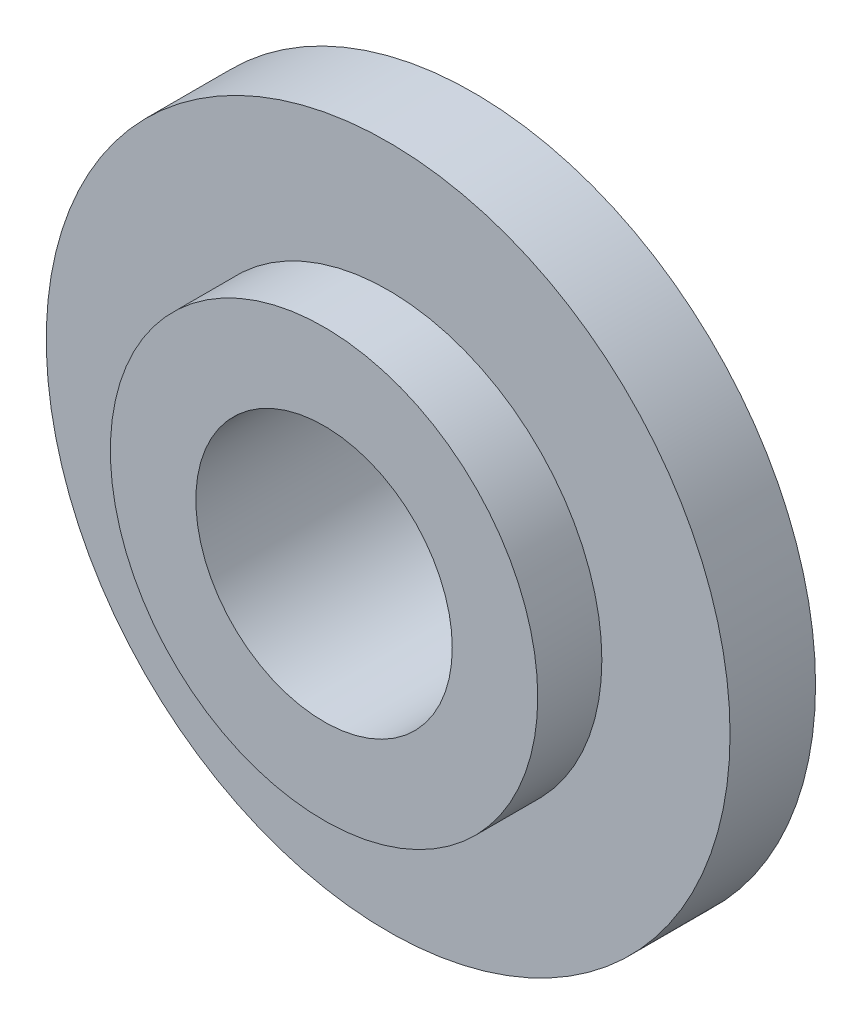
ISO-10303-21;
HEADER;
FILE_DESCRIPTION(('STEP AP214'),'2;1');
FILE_NAME('part.step','',(''),(''),'','','');
FILE_SCHEMA(('AUTOMOTIVE_DESIGN { 1 0 10303 214 1 1 1 1 }'));
ENDSEC;
DATA;
#1=APPLICATION_CONTEXT('core data for automotive mechanical design processes');
#2=APPLICATION_PROTOCOL_DEFINITION('international standard','automotive_design',2000,#1);
#3=PRODUCT_CONTEXT('',#1,'mechanical');
#4=PRODUCT('Part','Part','',(#3));
#5=PRODUCT_RELATED_PRODUCT_CATEGORY('part','',(#4));
#6=PRODUCT_DEFINITION_FORMATION('','',#4);
#7=PRODUCT_DEFINITION_CONTEXT('part definition',#1,'design');
#8=PRODUCT_DEFINITION('design','',#6,#7);
#9=PRODUCT_DEFINITION_SHAPE('','',#8);
#10=(LENGTH_UNIT() NAMED_UNIT(*) SI_UNIT(.MILLI.,.METRE.));
#11=(NAMED_UNIT(*) PLANE_ANGLE_UNIT() SI_UNIT($,.RADIAN.));
#12=(NAMED_UNIT(*) SI_UNIT($,.STERADIAN.) SOLID_ANGLE_UNIT());
#13=UNCERTAINTY_MEASURE_WITH_UNIT(LENGTH_MEASURE(1.E-05),#10,'distance_accuracy_value','');
#14=(GEOMETRIC_REPRESENTATION_CONTEXT(3) GLOBAL_UNCERTAINTY_ASSIGNED_CONTEXT((#13)) GLOBAL_UNIT_ASSIGNED_CONTEXT((#10,
#11,#12)) REPRESENTATION_CONTEXT('',''));
#15=CARTESIAN_POINT('',(0.,0.,0.));
#16=DIRECTION('',(0.,0.,1.));
#17=DIRECTION('',(1.,0.,0.));
#18=AXIS2_PLACEMENT_3D('',#15,#16,#17);
#19=CARTESIAN_POINT('',(0.,0.,25.));
#20=DIRECTION('',(0.,0.,-1.));
#21=DIRECTION('',(-1.,0.,0.));
#22=AXIS2_PLACEMENT_3D('',#19,#20,#21);
#23=CYLINDRICAL_SURFACE('',#22,50.);
#24=CARTESIAN_POINT('',(0.,0.,-25.));
#25=DIRECTION('',(0.,0.,1.));
#26=DIRECTION('',(1.,0.,0.));
#27=AXIS2_PLACEMENT_3D('',#24,#25,#26);
#28=CIRCLE('',#27,50.);
#29=CARTESIAN_POINT('',(50.,0.,-25.));
#30=VERTEX_POINT('',#29);
#31=EDGE_CURVE('E43',#30,#30,#28,.T.);
#32=ORIENTED_EDGE('',*,*,#31,.T.);
#33=EDGE_LOOP('',(#32));
#34=FACE_BOUND('',#33,.T.);
#35=CARTESIAN_POINT('',(0.,0.,-10.));
#36=DIRECTION('',(0.,0.,1.));
#37=DIRECTION('',(1.,0.,0.));
#38=AXIS2_PLACEMENT_3D('',#35,#36,#37);
#39=CIRCLE('',#38,50.);
#40=CARTESIAN_POINT('',(50.,0.,-10.));
#41=VERTEX_POINT('',#40);
#42=EDGE_CURVE('E10',#41,#41,#39,.T.);
#43=ORIENTED_EDGE('',*,*,#42,.F.);
#44=EDGE_LOOP('',(#43));
#45=FACE_BOUND('',#44,.T.);
#46=ADVANCED_FACE('F32',(#34,#45),#23,.T.);
#47=CARTESIAN_POINT('',(0.,0.,25.));
#48=DIRECTION('',(0.,0.,1.));
#49=DIRECTION('',(1.,0.,0.));
#50=AXIS2_PLACEMENT_3D('',#47,#48,#49);
#51=PLANE('',#50);
#52=CARTESIAN_POINT('',(0.,0.,25.));
#53=DIRECTION('',(0.,0.,1.));
#54=DIRECTION('',(1.,0.,0.));
#55=AXIS2_PLACEMENT_3D('',#52,#53,#54);
#56=CIRCLE('',#55,50.);
#57=CARTESIAN_POINT('',(50.,0.,25.));
#58=VERTEX_POINT('',#57);
#59=EDGE_CURVE('E39',#58,#58,#56,.T.);
#60=ORIENTED_EDGE('',*,*,#59,.T.);
#61=EDGE_LOOP('',(#60));
#62=FACE_BOUND('',#61,.T.);
#63=CARTESIAN_POINT('',(0.,0.,25.));
#64=DIRECTION('',(0.,0.,1.));
#65=DIRECTION('',(1.,0.,0.));
#66=AXIS2_PLACEMENT_3D('',#63,#64,#65);
#67=CIRCLE('',#66,30.);
#68=CARTESIAN_POINT('',(30.,0.,25.));
#69=VERTEX_POINT('',#68);
#70=EDGE_CURVE('E48',#69,#69,#67,.T.);
#71=ORIENTED_EDGE('',*,*,#70,.F.);
#72=EDGE_LOOP('',(#71));
#73=FACE_BOUND('',#72,.T.);
#74=ADVANCED_FACE('F83',(#62,#73),#51,.T.);
#75=CARTESIAN_POINT('',(0.,0.,-25.));
#76=DIRECTION('',(0.,0.,1.));
#77=DIRECTION('',(1.,0.,0.));
#78=AXIS2_PLACEMENT_3D('',#75,#76,#77);
#79=PLANE('',#78);
#80=ORIENTED_EDGE('',*,*,#31,.F.);
#81=EDGE_LOOP('',(#80));
#82=FACE_BOUND('',#81,.T.);
#83=CARTESIAN_POINT('',(0.,0.,-25.));
#84=DIRECTION('',(0.,0.,1.));
#85=DIRECTION('',(1.,0.,0.));
#86=AXIS2_PLACEMENT_3D('',#83,#84,#85);
#87=CIRCLE('',#86,30.);
#88=CARTESIAN_POINT('',(30.,0.,-25.));
#89=VERTEX_POINT('',#88);
#90=EDGE_CURVE('E50',#89,#89,#87,.T.);
#91=ORIENTED_EDGE('',*,*,#90,.T.);
#92=EDGE_LOOP('',(#91));
#93=FACE_BOUND('',#92,.T.);
#94=ADVANCED_FACE('F88',(#82,#93),#79,.F.);
#95=CARTESIAN_POINT('',(0.,0.,10.));
#96=DIRECTION('',(0.,0.,1.));
#97=DIRECTION('',(1.,0.,0.));
#98=AXIS2_PLACEMENT_3D('',#95,#96,#97);
#99=CIRCLE('',#98,50.);
#100=CARTESIAN_POINT('',(50.,0.,10.));
#101=VERTEX_POINT('',#100);
#102=EDGE_CURVE('E59',#101,#101,#99,.T.);
#103=ORIENTED_EDGE('',*,*,#102,.T.);
#104=EDGE_LOOP('',(#103));
#105=FACE_BOUND('',#104,.T.);
#106=ORIENTED_EDGE('',*,*,#59,.F.);
#107=EDGE_LOOP('',(#106));
#108=FACE_BOUND('',#107,.T.);
#109=ADVANCED_FACE('F34',(#105,#108),#23,.T.);
#110=CARTESIAN_POINT('',(0.,0.,25.));
#111=DIRECTION('',(0.,0.,-1.));
#112=DIRECTION('',(-1.,0.,0.));
#113=AXIS2_PLACEMENT_3D('',#110,#111,#112);
#114=CYLINDRICAL_SURFACE('',#113,30.);
#115=ORIENTED_EDGE('',*,*,#70,.T.);
#116=EDGE_LOOP('',(#115));
#117=FACE_BOUND('',#116,.T.);
#118=ORIENTED_EDGE('',*,*,#90,.F.);
#119=EDGE_LOOP('',(#118));
#120=FACE_BOUND('',#119,.T.);
#121=ADVANCED_FACE('F70',(#117,#120),#114,.F.);
#122=CARTESIAN_POINT('',(0.,0.,10.));
#123=DIRECTION('',(0.,0.,1.));
#124=DIRECTION('',(1.,0.,0.));
#125=AXIS2_PLACEMENT_3D('',#122,#123,#124);
#126=PLANE('',#125);
#127=CARTESIAN_POINT('',(0.,0.,10.));
#128=DIRECTION('',(0.,0.,1.));
#129=DIRECTION('',(1.,0.,0.));
#130=AXIS2_PLACEMENT_3D('',#127,#128,#129);
#131=CIRCLE('',#130,80.);
#132=CARTESIAN_POINT('',(80.,0.,10.));
#133=VERTEX_POINT('',#132);
#134=EDGE_CURVE('E53',#133,#133,#131,.T.);
#135=ORIENTED_EDGE('',*,*,#134,.T.);
#136=EDGE_LOOP('',(#135));
#137=FACE_BOUND('',#136,.T.);
#138=ORIENTED_EDGE('',*,*,#102,.F.);
#139=EDGE_LOOP('',(#138));
#140=FACE_BOUND('',#139,.T.);
#141=ADVANCED_FACE('F67',(#137,#140),#126,.T.);
#142=CARTESIAN_POINT('',(0.,0.,-10.));
#143=DIRECTION('',(0.,0.,1.));
#144=DIRECTION('',(1.,0.,0.));
#145=AXIS2_PLACEMENT_3D('',#142,#143,#144);
#146=PLANE('',#145);
#147=CARTESIAN_POINT('',(0.,0.,-10.));
#148=DIRECTION('',(0.,0.,1.));
#149=DIRECTION('',(1.,0.,0.));
#150=AXIS2_PLACEMENT_3D('',#147,#148,#149);
#151=CIRCLE('',#150,80.);
#152=CARTESIAN_POINT('',(80.,0.,-10.));
#153=VERTEX_POINT('',#152);
#154=EDGE_CURVE('E56',#153,#153,#151,.T.);
#155=ORIENTED_EDGE('',*,*,#154,.F.);
#156=EDGE_LOOP('',(#155));
#157=FACE_BOUND('',#156,.T.);
#158=ORIENTED_EDGE('',*,*,#42,.T.);
#159=EDGE_LOOP('',(#158));
#160=FACE_BOUND('',#159,.T.);
#161=ADVANCED_FACE('F69',(#157,#160),#146,.F.);
#162=CARTESIAN_POINT('',(0.,0.,10.));
#163=DIRECTION('',(0.,0.,-1.));
#164=DIRECTION('',(-1.,0.,0.));
#165=AXIS2_PLACEMENT_3D('',#162,#163,#164);
#166=CYLINDRICAL_SURFACE('',#165,80.);
#167=ORIENTED_EDGE('',*,*,#134,.F.);
#168=EDGE_LOOP('',(#167));
#169=FACE_BOUND('',#168,.T.);
#170=ORIENTED_EDGE('',*,*,#154,.T.);
#171=EDGE_LOOP('',(#170));
#172=FACE_BOUND('',#171,.T.);
#173=ADVANCED_FACE('F77',(#169,#172),#166,.T.);
#174=CLOSED_SHELL('',(#46,#74,#94,#109,#121,#141,#161,#173));
#175=MANIFOLD_SOLID_BREP('B2',#174);
#176=ADVANCED_BREP_SHAPE_REPRESENTATION('',(#18,#175),#14);
#177=SHAPE_DEFINITION_REPRESENTATION(#9,#176);
ENDSEC;
END-ISO-10303-21;
